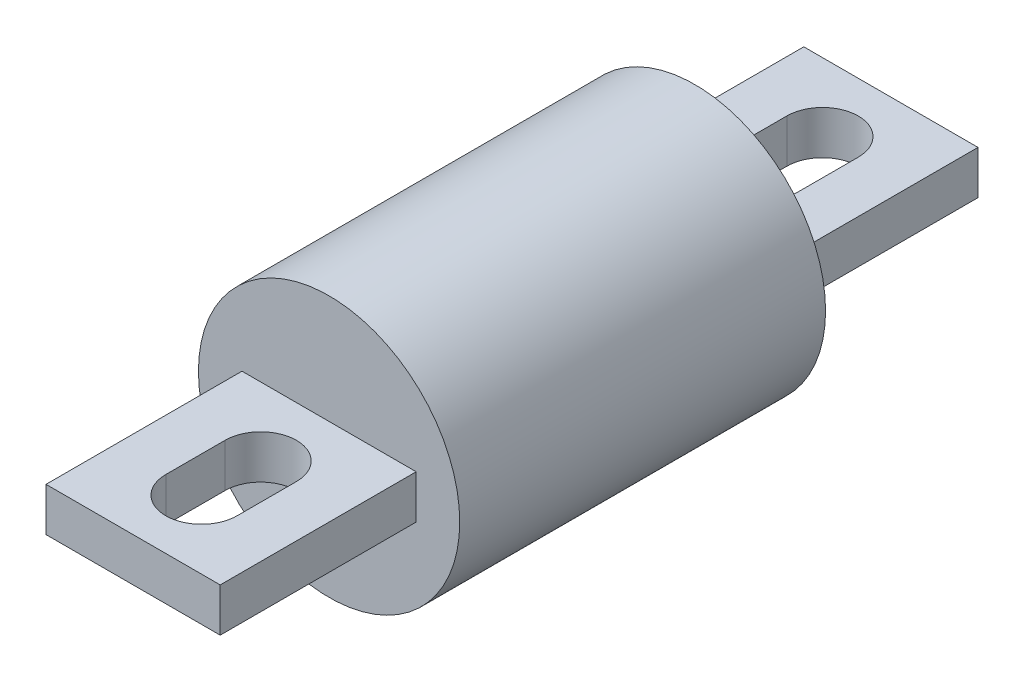
ISO-10303-21;
HEADER;
FILE_DESCRIPTION(('STEP AP214'),'2;1');
FILE_NAME('part.step','',(''),(''),'','','');
FILE_SCHEMA(('AUTOMOTIVE_DESIGN { 1 0 10303 214 1 1 1 1 }'));
ENDSEC;
DATA;
#1=APPLICATION_CONTEXT('core data for automotive mechanical design processes');
#2=APPLICATION_PROTOCOL_DEFINITION('international standard','automotive_design',2000,#1);
#3=PRODUCT_CONTEXT('',#1,'mechanical');
#4=PRODUCT('Part','Part','',(#3));
#5=PRODUCT_RELATED_PRODUCT_CATEGORY('part','',(#4));
#6=PRODUCT_DEFINITION_FORMATION('','',#4);
#7=PRODUCT_DEFINITION_CONTEXT('part definition',#1,'design');
#8=PRODUCT_DEFINITION('design','',#6,#7);
#9=PRODUCT_DEFINITION_SHAPE('','',#8);
#10=(LENGTH_UNIT() NAMED_UNIT(*) SI_UNIT(.MILLI.,.METRE.));
#11=(NAMED_UNIT(*) PLANE_ANGLE_UNIT() SI_UNIT($,.RADIAN.));
#12=(NAMED_UNIT(*) SI_UNIT($,.STERADIAN.) SOLID_ANGLE_UNIT());
#13=UNCERTAINTY_MEASURE_WITH_UNIT(LENGTH_MEASURE(1.E-05),#10,'distance_accuracy_value','');
#14=(GEOMETRIC_REPRESENTATION_CONTEXT(3) GLOBAL_UNCERTAINTY_ASSIGNED_CONTEXT((#13)) GLOBAL_UNIT_ASSIGNED_CONTEXT((#10,
#11,#12)) REPRESENTATION_CONTEXT('',''));
#15=CARTESIAN_POINT('',(0.,0.,0.));
#16=DIRECTION('',(0.,0.,1.));
#17=DIRECTION('',(1.,0.,0.));
#18=AXIS2_PLACEMENT_3D('',#15,#16,#17);
#19=CARTESIAN_POINT('',(0.,0.,-26.67));
#20=DIRECTION('',(0.,0.,1.));
#21=DIRECTION('',(1.,0.,0.));
#22=AXIS2_PLACEMENT_3D('',#19,#20,#21);
#23=CYLINDRICAL_SURFACE('',#22,19.05);
#24=CARTESIAN_POINT('',(0.,0.,-26.67));
#25=DIRECTION('',(0.,0.,1.));
#26=DIRECTION('',(1.,0.,0.));
#27=AXIS2_PLACEMENT_3D('',#24,#25,#26);
#28=CIRCLE('',#27,19.05);
#29=CARTESIAN_POINT('',(19.05,0.,-26.67));
#30=VERTEX_POINT('',#29);
#31=EDGE_CURVE('E11',#30,#30,#28,.T.);
#32=ORIENTED_EDGE('',*,*,#31,.T.);
#33=EDGE_LOOP('',(#32));
#34=FACE_BOUND('',#33,.T.);
#35=CARTESIAN_POINT('',(0.,0.,26.67));
#36=DIRECTION('',(0.,0.,1.));
#37=DIRECTION('',(1.,0.,0.));
#38=AXIS2_PLACEMENT_3D('',#35,#36,#37);
#39=CIRCLE('',#38,19.05);
#40=CARTESIAN_POINT('',(19.05,0.,26.67));
#41=VERTEX_POINT('',#40);
#42=EDGE_CURVE('E39',#41,#41,#39,.T.);
#43=ORIENTED_EDGE('',*,*,#42,.F.);
#44=EDGE_LOOP('',(#43));
#45=FACE_BOUND('',#44,.T.);
#46=ADVANCED_FACE('F32',(#34,#45),#23,.T.);
#47=CARTESIAN_POINT('',(0.,0.,-26.67));
#48=DIRECTION('',(0.,0.,1.));
#49=DIRECTION('',(1.,0.,0.));
#50=AXIS2_PLACEMENT_3D('',#47,#48,#49);
#51=PLANE('',#50);
#52=DIRECTION('',(0.,1.,0.));
#53=VECTOR('',#52,1.);
#54=CARTESIAN_POINT('',(-12.7,-3.175,-26.67));
#55=LINE('',#54,#53);
#56=CARTESIAN_POINT('',(-12.7,-3.175,-26.67));
#57=VERTEX_POINT('',#56);
#58=CARTESIAN_POINT('',(-12.7,3.175,-26.67));
#59=VERTEX_POINT('',#58);
#60=EDGE_CURVE('E54',#57,#59,#55,.T.);
#61=ORIENTED_EDGE('',*,*,#60,.F.);
#62=DIRECTION('',(1.,0.,0.));
#63=VECTOR('',#62,1.);
#64=CARTESIAN_POINT('',(-12.7,-3.175,-26.67));
#65=LINE('',#64,#63);
#66=CARTESIAN_POINT('',(12.7,-3.175,-26.67));
#67=VERTEX_POINT('',#66);
#68=EDGE_CURVE('E260',#57,#67,#65,.T.);
#69=ORIENTED_EDGE('',*,*,#68,.T.);
#70=DIRECTION('',(0.,1.,0.));
#71=VECTOR('',#70,1.);
#72=CARTESIAN_POINT('',(12.7,-3.175,-26.67));
#73=LINE('',#72,#71);
#74=CARTESIAN_POINT('',(12.7,3.175,-26.67));
#75=VERTEX_POINT('',#74);
#76=EDGE_CURVE('E272',#67,#75,#73,.T.);
#77=ORIENTED_EDGE('',*,*,#76,.T.);
#78=DIRECTION('',(1.,0.,0.));
#79=VECTOR('',#78,1.);
#80=CARTESIAN_POINT('',(-12.7,3.175,-26.67));
#81=LINE('',#80,#79);
#82=EDGE_CURVE('E228',#59,#75,#81,.T.);
#83=ORIENTED_EDGE('',*,*,#82,.F.);
#84=EDGE_LOOP('',(#61,#69,#77,#83));
#85=FACE_BOUND('',#84,.T.);
#86=ORIENTED_EDGE('',*,*,#31,.F.);
#87=EDGE_LOOP('',(#86));
#88=FACE_BOUND('',#87,.T.);
#89=ADVANCED_FACE('F280',(#85,#88),#51,.F.);
#90=CARTESIAN_POINT('',(0.,0.,26.67));
#91=DIRECTION('',(0.,0.,1.));
#92=DIRECTION('',(1.,0.,0.));
#93=AXIS2_PLACEMENT_3D('',#90,#91,#92);
#94=PLANE('',#93);
#95=DIRECTION('',(1.,0.,0.));
#96=VECTOR('',#95,1.);
#97=CARTESIAN_POINT('',(-12.7,-3.175,26.67));
#98=LINE('',#97,#96);
#99=CARTESIAN_POINT('',(-12.7,-3.175,26.67));
#100=VERTEX_POINT('',#99);
#101=CARTESIAN_POINT('',(12.7,-3.175,26.67));
#102=VERTEX_POINT('',#101);
#103=EDGE_CURVE('E202',#100,#102,#98,.T.);
#104=ORIENTED_EDGE('',*,*,#103,.F.);
#105=DIRECTION('',(0.,1.,0.));
#106=VECTOR('',#105,1.);
#107=CARTESIAN_POINT('',(-12.7,-3.175,26.67));
#108=LINE('',#107,#106);
#109=CARTESIAN_POINT('',(-12.7,3.175,26.67));
#110=VERTEX_POINT('',#109);
#111=EDGE_CURVE('E205',#100,#110,#108,.T.);
#112=ORIENTED_EDGE('',*,*,#111,.T.);
#113=DIRECTION('',(1.,0.,0.));
#114=VECTOR('',#113,1.);
#115=CARTESIAN_POINT('',(-12.7,3.175,26.67));
#116=LINE('',#115,#114);
#117=CARTESIAN_POINT('',(12.7,3.175,26.67));
#118=VERTEX_POINT('',#117);
#119=EDGE_CURVE('E182',#110,#118,#116,.T.);
#120=ORIENTED_EDGE('',*,*,#119,.T.);
#121=DIRECTION('',(0.,1.,0.));
#122=VECTOR('',#121,1.);
#123=CARTESIAN_POINT('',(12.7,-3.175,26.67));
#124=LINE('',#123,#122);
#125=EDGE_CURVE('E209',#102,#118,#124,.T.);
#126=ORIENTED_EDGE('',*,*,#125,.F.);
#127=EDGE_LOOP('',(#104,#112,#120,#126));
#128=FACE_BOUND('',#127,.T.);
#129=ORIENTED_EDGE('',*,*,#42,.T.);
#130=EDGE_LOOP('',(#129));
#131=FACE_BOUND('',#130,.T.);
#132=ADVANCED_FACE('F277',(#128,#131),#94,.T.);
#133=CARTESIAN_POINT('',(-12.7,-3.175,-26.67));
#134=DIRECTION('',(-1.,0.,0.));
#135=DIRECTION('',(0.,0.,1.));
#136=AXIS2_PLACEMENT_3D('',#133,#134,#135);
#137=PLANE('',#136);
#138=ORIENTED_EDGE('',*,*,#60,.T.);
#139=DIRECTION('',(0.,0.,1.));
#140=VECTOR('',#139,1.);
#141=CARTESIAN_POINT('',(-12.7,3.175,-26.67));
#142=LINE('',#141,#140);
#143=CARTESIAN_POINT('',(-12.7,3.175,-55.245));
#144=VERTEX_POINT('',#143);
#145=EDGE_CURVE('E225',#144,#59,#142,.T.);
#146=ORIENTED_EDGE('',*,*,#145,.F.);
#147=DIRECTION('',(0.,1.,0.));
#148=VECTOR('',#147,1.);
#149=CARTESIAN_POINT('',(-12.7,-3.175,-55.245));
#150=LINE('',#149,#148);
#151=CARTESIAN_POINT('',(-12.7,-3.175,-55.245));
#152=VERTEX_POINT('',#151);
#153=EDGE_CURVE('E268',#152,#144,#150,.T.);
#154=ORIENTED_EDGE('',*,*,#153,.F.);
#155=DIRECTION('',(0.,0.,1.));
#156=VECTOR('',#155,1.);
#157=CARTESIAN_POINT('',(-12.7,-3.175,-26.67));
#158=LINE('',#157,#156);
#159=EDGE_CURVE('E252',#152,#57,#158,.T.);
#160=ORIENTED_EDGE('',*,*,#159,.T.);
#161=EDGE_LOOP('',(#138,#146,#154,#160));
#162=FACE_BOUND('',#161,.T.);
#163=ADVANCED_FACE('F290',(#162),#137,.T.);
#164=CARTESIAN_POINT('',(-12.7,-3.175,-55.245));
#165=DIRECTION('',(0.,0.,-1.));
#166=DIRECTION('',(-1.,0.,0.));
#167=AXIS2_PLACEMENT_3D('',#164,#165,#166);
#168=PLANE('',#167);
#169=ORIENTED_EDGE('',*,*,#153,.T.);
#170=DIRECTION('',(-1.,0.,0.));
#171=VECTOR('',#170,1.);
#172=CARTESIAN_POINT('',(-12.7,3.175,-55.245));
#173=LINE('',#172,#171);
#174=CARTESIAN_POINT('',(12.7,3.175,-55.245));
#175=VERTEX_POINT('',#174);
#176=EDGE_CURVE('E234',#175,#144,#173,.T.);
#177=ORIENTED_EDGE('',*,*,#176,.F.);
#178=DIRECTION('',(0.,1.,0.));
#179=VECTOR('',#178,1.);
#180=CARTESIAN_POINT('',(12.7,-3.175,-55.245));
#181=LINE('',#180,#179);
#182=CARTESIAN_POINT('',(12.7,-3.175,-55.245));
#183=VERTEX_POINT('',#182);
#184=EDGE_CURVE('E270',#183,#175,#181,.T.);
#185=ORIENTED_EDGE('',*,*,#184,.F.);
#186=DIRECTION('',(-1.,0.,0.));
#187=VECTOR('',#186,1.);
#188=CARTESIAN_POINT('',(-12.7,-3.175,-55.245));
#189=LINE('',#188,#187);
#190=EDGE_CURVE('E265',#183,#152,#189,.T.);
#191=ORIENTED_EDGE('',*,*,#190,.T.);
#192=EDGE_LOOP('',(#169,#177,#185,#191));
#193=FACE_BOUND('',#192,.T.);
#194=ADVANCED_FACE('F296',(#193),#168,.T.);
#195=CARTESIAN_POINT('',(12.7,-3.175,-26.67));
#196=DIRECTION('',(1.,0.,0.));
#197=DIRECTION('',(0.,0.,-1.));
#198=AXIS2_PLACEMENT_3D('',#195,#196,#197);
#199=PLANE('',#198);
#200=ORIENTED_EDGE('',*,*,#184,.T.);
#201=DIRECTION('',(0.,0.,-1.));
#202=VECTOR('',#201,1.);
#203=CARTESIAN_POINT('',(12.7,3.175,-26.67));
#204=LINE('',#203,#202);
#205=EDGE_CURVE('E231',#75,#175,#204,.T.);
#206=ORIENTED_EDGE('',*,*,#205,.F.);
#207=ORIENTED_EDGE('',*,*,#76,.F.);
#208=DIRECTION('',(0.,0.,-1.));
#209=VECTOR('',#208,1.);
#210=CARTESIAN_POINT('',(12.7,-3.175,-26.67));
#211=LINE('',#210,#209);
#212=EDGE_CURVE('E262',#67,#183,#211,.T.);
#213=ORIENTED_EDGE('',*,*,#212,.T.);
#214=EDGE_LOOP('',(#200,#206,#207,#213));
#215=FACE_BOUND('',#214,.T.);
#216=ADVANCED_FACE('F298',(#215),#199,.T.);
#217=CARTESIAN_POINT('',(0.,-3.175,0.));
#218=DIRECTION('',(0.,-1.,0.));
#219=DIRECTION('',(0.,0.,-1.));
#220=AXIS2_PLACEMENT_3D('',#217,#218,#219);
#221=PLANE('',#220);
#222=CARTESIAN_POINT('',(0.,-3.175,-36.6395));
#223=DIRECTION('',(0.,1.,0.));
#224=DIRECTION('',(0.,0.,1.));
#225=AXIS2_PLACEMENT_3D('',#222,#223,#224);
#226=CIRCLE('',#225,5.207);
#227=CARTESIAN_POINT('',(-5.207,-3.175,-36.6395));
#228=VERTEX_POINT('',#227);
#229=CARTESIAN_POINT('',(5.207,-3.175,-36.6395));
#230=VERTEX_POINT('',#229);
#231=EDGE_CURVE('E237',#228,#230,#226,.T.);
#232=ORIENTED_EDGE('',*,*,#231,.T.);
#233=DIRECTION('',(0.,0.,-1.));
#234=VECTOR('',#233,1.);
#235=CARTESIAN_POINT('',(5.207,-3.175,-36.6395));
#236=LINE('',#235,#234);
#237=CARTESIAN_POINT('',(5.207,-3.175,-45.2755));
#238=VERTEX_POINT('',#237);
#239=EDGE_CURVE('E240',#230,#238,#236,.T.);
#240=ORIENTED_EDGE('',*,*,#239,.T.);
#241=CARTESIAN_POINT('',(0.,-3.175,-45.2755));
#242=DIRECTION('',(0.,1.,0.));
#243=DIRECTION('',(0.,0.,1.));
#244=AXIS2_PLACEMENT_3D('',#241,#242,#243);
#245=CIRCLE('',#244,5.207);
#246=CARTESIAN_POINT('',(-5.207,-3.175,-45.2755));
#247=VERTEX_POINT('',#246);
#248=EDGE_CURVE('E243',#238,#247,#245,.T.);
#249=ORIENTED_EDGE('',*,*,#248,.T.);
#250=DIRECTION('',(0.,0.,1.));
#251=VECTOR('',#250,1.);
#252=CARTESIAN_POINT('',(-5.207,-3.175,-36.6395));
#253=LINE('',#252,#251);
#254=EDGE_CURVE('E246',#247,#228,#253,.T.);
#255=ORIENTED_EDGE('',*,*,#254,.T.);
#256=EDGE_LOOP('',(#232,#240,#249,#255));
#257=FACE_BOUND('',#256,.T.);
#258=ORIENTED_EDGE('',*,*,#159,.F.);
#259=ORIENTED_EDGE('',*,*,#190,.F.);
#260=ORIENTED_EDGE('',*,*,#212,.F.);
#261=ORIENTED_EDGE('',*,*,#68,.F.);
#262=EDGE_LOOP('',(#258,#259,#260,#261));
#263=FACE_BOUND('',#262,.T.);
#264=ADVANCED_FACE('F301',(#257,#263),#221,.T.);
#265=CARTESIAN_POINT('',(0.,-3.175,-36.6395));
#266=DIRECTION('',(0.,1.,0.));
#267=DIRECTION('',(0.,0.,1.));
#268=AXIS2_PLACEMENT_3D('',#265,#266,#267);
#269=CYLINDRICAL_SURFACE('',#268,5.207);
#270=DIRECTION('',(0.,1.,0.));
#271=VECTOR('',#270,1.);
#272=CARTESIAN_POINT('',(-5.207,-3.175,-36.6395));
#273=LINE('',#272,#271);
#274=CARTESIAN_POINT('',(-5.207,3.175,-36.6395));
#275=VERTEX_POINT('',#274);
#276=EDGE_CURVE('E250',#228,#275,#273,.T.);
#277=ORIENTED_EDGE('',*,*,#276,.T.);
#278=CARTESIAN_POINT('',(0.,3.175,-36.6395));
#279=DIRECTION('',(0.,1.,0.));
#280=DIRECTION('',(0.,0.,1.));
#281=AXIS2_PLACEMENT_3D('',#278,#279,#280);
#282=CIRCLE('',#281,5.207);
#283=CARTESIAN_POINT('',(5.207,3.175,-36.6395));
#284=VERTEX_POINT('',#283);
#285=EDGE_CURVE('E208',#275,#284,#282,.T.);
#286=ORIENTED_EDGE('',*,*,#285,.T.);
#287=DIRECTION('',(0.,1.,0.));
#288=VECTOR('',#287,1.);
#289=CARTESIAN_POINT('',(5.207,-3.175,-36.6395));
#290=LINE('',#289,#288);
#291=EDGE_CURVE('E249',#230,#284,#290,.T.);
#292=ORIENTED_EDGE('',*,*,#291,.F.);
#293=ORIENTED_EDGE('',*,*,#231,.F.);
#294=EDGE_LOOP('',(#277,#286,#292,#293));
#295=FACE_BOUND('',#294,.T.);
#296=ADVANCED_FACE('F308',(#295),#269,.F.);
#297=CARTESIAN_POINT('',(-5.207,-3.175,-36.6395));
#298=DIRECTION('',(-1.,0.,0.));
#299=DIRECTION('',(0.,0.,1.));
#300=AXIS2_PLACEMENT_3D('',#297,#298,#299);
#301=PLANE('',#300);
#302=DIRECTION('',(0.,1.,0.));
#303=VECTOR('',#302,1.);
#304=CARTESIAN_POINT('',(-5.207,-3.175,-45.2755));
#305=LINE('',#304,#303);
#306=CARTESIAN_POINT('',(-5.207,3.175,-45.2755));
#307=VERTEX_POINT('',#306);
#308=EDGE_CURVE('E253',#247,#307,#305,.T.);
#309=ORIENTED_EDGE('',*,*,#308,.T.);
#310=DIRECTION('',(0.,0.,1.));
#311=VECTOR('',#310,1.);
#312=CARTESIAN_POINT('',(-5.207,3.175,-36.6395));
#313=LINE('',#312,#311);
#314=EDGE_CURVE('E222',#307,#275,#313,.T.);
#315=ORIENTED_EDGE('',*,*,#314,.T.);
#316=ORIENTED_EDGE('',*,*,#276,.F.);
#317=ORIENTED_EDGE('',*,*,#254,.F.);
#318=EDGE_LOOP('',(#309,#315,#316,#317));
#319=FACE_BOUND('',#318,.T.);
#320=ADVANCED_FACE('F312',(#319),#301,.F.);
#321=CARTESIAN_POINT('',(0.,-3.175,-45.2755));
#322=DIRECTION('',(0.,1.,0.));
#323=DIRECTION('',(0.,0.,1.));
#324=AXIS2_PLACEMENT_3D('',#321,#322,#323);
#325=CYLINDRICAL_SURFACE('',#324,5.207);
#326=DIRECTION('',(0.,1.,0.));
#327=VECTOR('',#326,1.);
#328=CARTESIAN_POINT('',(5.207,-3.175,-45.2755));
#329=LINE('',#328,#327);
#330=CARTESIAN_POINT('',(5.207,3.175,-45.2755));
#331=VERTEX_POINT('',#330);
#332=EDGE_CURVE('E255',#238,#331,#329,.T.);
#333=ORIENTED_EDGE('',*,*,#332,.T.);
#334=CARTESIAN_POINT('',(0.,3.175,-45.2755));
#335=DIRECTION('',(0.,1.,0.));
#336=DIRECTION('',(0.,0.,1.));
#337=AXIS2_PLACEMENT_3D('',#334,#335,#336);
#338=CIRCLE('',#337,5.207);
#339=EDGE_CURVE('E219',#331,#307,#338,.T.);
#340=ORIENTED_EDGE('',*,*,#339,.T.);
#341=ORIENTED_EDGE('',*,*,#308,.F.);
#342=ORIENTED_EDGE('',*,*,#248,.F.);
#343=EDGE_LOOP('',(#333,#340,#341,#342));
#344=FACE_BOUND('',#343,.T.);
#345=ADVANCED_FACE('F318',(#344),#325,.F.);
#346=CARTESIAN_POINT('',(5.207,-3.175,-36.6395));
#347=DIRECTION('',(1.,0.,0.));
#348=DIRECTION('',(0.,0.,-1.));
#349=AXIS2_PLACEMENT_3D('',#346,#347,#348);
#350=PLANE('',#349);
#351=ORIENTED_EDGE('',*,*,#291,.T.);
#352=DIRECTION('',(0.,0.,-1.));
#353=VECTOR('',#352,1.);
#354=CARTESIAN_POINT('',(5.207,3.175,-36.6395));
#355=LINE('',#354,#353);
#356=EDGE_CURVE('E216',#284,#331,#355,.T.);
#357=ORIENTED_EDGE('',*,*,#356,.T.);
#358=ORIENTED_EDGE('',*,*,#332,.F.);
#359=ORIENTED_EDGE('',*,*,#239,.F.);
#360=EDGE_LOOP('',(#351,#357,#358,#359));
#361=FACE_BOUND('',#360,.T.);
#362=ADVANCED_FACE('F314',(#361),#350,.F.);
#363=CARTESIAN_POINT('',(0.,3.175,0.));
#364=DIRECTION('',(0.,-1.,0.));
#365=DIRECTION('',(0.,0.,-1.));
#366=AXIS2_PLACEMENT_3D('',#363,#364,#365);
#367=PLANE('',#366);
#368=ORIENTED_EDGE('',*,*,#145,.T.);
#369=ORIENTED_EDGE('',*,*,#82,.T.);
#370=ORIENTED_EDGE('',*,*,#205,.T.);
#371=ORIENTED_EDGE('',*,*,#176,.T.);
#372=EDGE_LOOP('',(#368,#369,#370,#371));
#373=FACE_BOUND('',#372,.T.);
#374=ORIENTED_EDGE('',*,*,#285,.F.);
#375=ORIENTED_EDGE('',*,*,#314,.F.);
#376=ORIENTED_EDGE('',*,*,#339,.F.);
#377=ORIENTED_EDGE('',*,*,#356,.F.);
#378=EDGE_LOOP('',(#374,#375,#376,#377));
#379=FACE_BOUND('',#378,.T.);
#380=ADVANCED_FACE('F317',(#373,#379),#367,.F.);
#381=CARTESIAN_POINT('',(0.,-3.175,0.));
#382=DIRECTION('',(0.,-1.,0.));
#383=DIRECTION('',(0.,0.,1.));
#384=AXIS2_PLACEMENT_3D('',#381,#382,#383);
#385=PLANE('',#384);
#386=DIRECTION('',(0.,0.,-1.));
#387=VECTOR('',#386,1.);
#388=CARTESIAN_POINT('',(-12.7,-3.175,26.67));
#389=LINE('',#388,#387);
#390=CARTESIAN_POINT('',(-12.7,-3.175,55.245));
#391=VERTEX_POINT('',#390);
#392=EDGE_CURVE('E193',#391,#100,#389,.T.);
#393=ORIENTED_EDGE('',*,*,#392,.T.);
#394=ORIENTED_EDGE('',*,*,#103,.T.);
#395=DIRECTION('',(0.,0.,1.));
#396=VECTOR('',#395,1.);
#397=CARTESIAN_POINT('',(12.7,-3.175,26.67));
#398=LINE('',#397,#396);
#399=CARTESIAN_POINT('',(12.7,-3.175,55.245));
#400=VERTEX_POINT('',#399);
#401=EDGE_CURVE('E200',#102,#400,#398,.T.);
#402=ORIENTED_EDGE('',*,*,#401,.T.);
#403=DIRECTION('',(-1.,0.,0.));
#404=VECTOR('',#403,1.);
#405=CARTESIAN_POINT('',(-12.7,-3.175,55.245));
#406=LINE('',#405,#404);
#407=EDGE_CURVE('E198',#400,#391,#406,.T.);
#408=ORIENTED_EDGE('',*,*,#407,.T.);
#409=EDGE_LOOP('',(#393,#394,#402,#408));
#410=FACE_BOUND('',#409,.T.);
#411=DIRECTION('',(0.,0.,1.));
#412=VECTOR('',#411,1.);
#413=CARTESIAN_POINT('',(5.207,-3.175,36.6395));
#414=LINE('',#413,#412);
#415=CARTESIAN_POINT('',(5.207,-3.175,36.6395));
#416=VERTEX_POINT('',#415);
#417=CARTESIAN_POINT('',(5.207,-3.175,45.2755));
#418=VERTEX_POINT('',#417);
#419=EDGE_CURVE('E157',#416,#418,#414,.T.);
#420=ORIENTED_EDGE('',*,*,#419,.F.);
#421=CARTESIAN_POINT('',(0.,-3.175,36.6395));
#422=DIRECTION('',(0.,-1.,0.));
#423=DIRECTION('',(0.,0.,-1.));
#424=AXIS2_PLACEMENT_3D('',#421,#422,#423);
#425=CIRCLE('',#424,5.207);
#426=CARTESIAN_POINT('',(-5.207,-3.175,36.6395));
#427=VERTEX_POINT('',#426);
#428=EDGE_CURVE('E185',#427,#416,#425,.T.);
#429=ORIENTED_EDGE('',*,*,#428,.F.);
#430=DIRECTION('',(0.,0.,-1.));
#431=VECTOR('',#430,1.);
#432=CARTESIAN_POINT('',(-5.207,-3.175,36.6395));
#433=LINE('',#432,#431);
#434=CARTESIAN_POINT('',(-5.207,-3.175,45.2755));
#435=VERTEX_POINT('',#434);
#436=EDGE_CURVE('E153',#435,#427,#433,.T.);
#437=ORIENTED_EDGE('',*,*,#436,.F.);
#438=CARTESIAN_POINT('',(0.,-3.175,45.2755));
#439=DIRECTION('',(0.,-1.,0.));
#440=DIRECTION('',(0.,0.,-1.));
#441=AXIS2_PLACEMENT_3D('',#438,#439,#440);
#442=CIRCLE('',#441,5.207);
#443=EDGE_CURVE('E188',#418,#435,#442,.T.);
#444=ORIENTED_EDGE('',*,*,#443,.F.);
#445=EDGE_LOOP('',(#420,#429,#437,#444));
#446=FACE_BOUND('',#445,.T.);
#447=ADVANCED_FACE('F328',(#410,#446),#385,.T.);
#448=CARTESIAN_POINT('',(-12.7,-3.175,26.67));
#449=DIRECTION('',(1.,0.,0.));
#450=DIRECTION('',(0.,0.,-1.));
#451=AXIS2_PLACEMENT_3D('',#448,#449,#450);
#452=PLANE('',#451);
#453=DIRECTION('',(0.,1.,0.));
#454=VECTOR('',#453,1.);
#455=CARTESIAN_POINT('',(-12.7,-3.175,55.245));
#456=LINE('',#455,#454);
#457=CARTESIAN_POINT('',(-12.7,3.175,55.245));
#458=VERTEX_POINT('',#457);
#459=EDGE_CURVE('E204',#391,#458,#456,.T.);
#460=ORIENTED_EDGE('',*,*,#459,.T.);
#461=DIRECTION('',(0.,0.,-1.));
#462=VECTOR('',#461,1.);
#463=CARTESIAN_POINT('',(-12.7,3.175,26.67));
#464=LINE('',#463,#462);
#465=EDGE_CURVE('E176',#458,#110,#464,.T.);
#466=ORIENTED_EDGE('',*,*,#465,.T.);
#467=ORIENTED_EDGE('',*,*,#111,.F.);
#468=ORIENTED_EDGE('',*,*,#392,.F.);
#469=EDGE_LOOP('',(#460,#466,#467,#468));
#470=FACE_BOUND('',#469,.T.);
#471=ADVANCED_FACE('F330',(#470),#452,.F.);
#472=CARTESIAN_POINT('',(12.7,-3.175,26.67));
#473=DIRECTION('',(-1.,0.,0.));
#474=DIRECTION('',(0.,0.,1.));
#475=AXIS2_PLACEMENT_3D('',#472,#473,#474);
#476=PLANE('',#475);
#477=ORIENTED_EDGE('',*,*,#125,.T.);
#478=DIRECTION('',(0.,0.,1.));
#479=VECTOR('',#478,1.);
#480=CARTESIAN_POINT('',(12.7,3.175,26.67));
#481=LINE('',#480,#479);
#482=CARTESIAN_POINT('',(12.7,3.175,55.245));
#483=VERTEX_POINT('',#482);
#484=EDGE_CURVE('E46',#118,#483,#481,.T.);
#485=ORIENTED_EDGE('',*,*,#484,.T.);
#486=DIRECTION('',(0.,1.,0.));
#487=VECTOR('',#486,1.);
#488=CARTESIAN_POINT('',(12.7,-3.175,55.245));
#489=LINE('',#488,#487);
#490=EDGE_CURVE('E211',#400,#483,#489,.T.);
#491=ORIENTED_EDGE('',*,*,#490,.F.);
#492=ORIENTED_EDGE('',*,*,#401,.F.);
#493=EDGE_LOOP('',(#477,#485,#491,#492));
#494=FACE_BOUND('',#493,.T.);
#495=ADVANCED_FACE('F333',(#494),#476,.F.);
#496=CARTESIAN_POINT('',(-12.7,-3.175,55.245));
#497=DIRECTION('',(0.,0.,-1.));
#498=DIRECTION('',(-1.,0.,0.));
#499=AXIS2_PLACEMENT_3D('',#496,#497,#498);
#500=PLANE('',#499);
#501=ORIENTED_EDGE('',*,*,#490,.T.);
#502=DIRECTION('',(-1.,0.,0.));
#503=VECTOR('',#502,1.);
#504=CARTESIAN_POINT('',(-12.7,3.175,55.245));
#505=LINE('',#504,#503);
#506=EDGE_CURVE('E178',#483,#458,#505,.T.);
#507=ORIENTED_EDGE('',*,*,#506,.T.);
#508=ORIENTED_EDGE('',*,*,#459,.F.);
#509=ORIENTED_EDGE('',*,*,#407,.F.);
#510=EDGE_LOOP('',(#501,#507,#508,#509));
#511=FACE_BOUND('',#510,.T.);
#512=ADVANCED_FACE('F335',(#511),#500,.F.);
#513=CARTESIAN_POINT('',(0.,-3.175,36.6395));
#514=DIRECTION('',(0.,1.,0.));
#515=DIRECTION('',(0.,0.,1.));
#516=AXIS2_PLACEMENT_3D('',#513,#514,#515);
#517=CYLINDRICAL_SURFACE('',#516,5.207);
#518=DIRECTION('',(0.,1.,0.));
#519=VECTOR('',#518,1.);
#520=CARTESIAN_POINT('',(5.207,-3.175,36.6395));
#521=LINE('',#520,#519);
#522=CARTESIAN_POINT('',(5.207,3.175,36.6395));
#523=VERTEX_POINT('',#522);
#524=EDGE_CURVE('E163',#416,#523,#521,.T.);
#525=ORIENTED_EDGE('',*,*,#524,.T.);
#526=CARTESIAN_POINT('',(0.,3.175,36.6395));
#527=DIRECTION('',(0.,-1.,0.));
#528=DIRECTION('',(0.,0.,-1.));
#529=AXIS2_PLACEMENT_3D('',#526,#527,#528);
#530=CIRCLE('',#529,5.207);
#531=CARTESIAN_POINT('',(-5.207,3.175,36.6395));
#532=VERTEX_POINT('',#531);
#533=EDGE_CURVE('E160',#532,#523,#530,.T.);
#534=ORIENTED_EDGE('',*,*,#533,.F.);
#535=DIRECTION('',(0.,1.,0.));
#536=VECTOR('',#535,1.);
#537=CARTESIAN_POINT('',(-5.207,-3.175,36.6395));
#538=LINE('',#537,#536);
#539=EDGE_CURVE('E146',#427,#532,#538,.T.);
#540=ORIENTED_EDGE('',*,*,#539,.F.);
#541=ORIENTED_EDGE('',*,*,#428,.T.);
#542=EDGE_LOOP('',(#525,#534,#540,#541));
#543=FACE_BOUND('',#542,.T.);
#544=ADVANCED_FACE('F161',(#543),#517,.F.);
#545=CARTESIAN_POINT('',(5.207,-3.175,36.6395));
#546=DIRECTION('',(-1.,0.,0.));
#547=DIRECTION('',(0.,0.,1.));
#548=AXIS2_PLACEMENT_3D('',#545,#546,#547);
#549=PLANE('',#548);
#550=DIRECTION('',(0.,1.,0.));
#551=VECTOR('',#550,1.);
#552=CARTESIAN_POINT('',(5.207,-3.175,45.2755));
#553=LINE('',#552,#551);
#554=CARTESIAN_POINT('',(5.207,3.175,45.2755));
#555=VERTEX_POINT('',#554);
#556=EDGE_CURVE('E194',#418,#555,#553,.T.);
#557=ORIENTED_EDGE('',*,*,#556,.T.);
#558=DIRECTION('',(0.,0.,1.));
#559=VECTOR('',#558,1.);
#560=CARTESIAN_POINT('',(5.207,3.175,36.6395));
#561=LINE('',#560,#559);
#562=EDGE_CURVE('E172',#523,#555,#561,.T.);
#563=ORIENTED_EDGE('',*,*,#562,.F.);
#564=ORIENTED_EDGE('',*,*,#524,.F.);
#565=ORIENTED_EDGE('',*,*,#419,.T.);
#566=EDGE_LOOP('',(#557,#563,#564,#565));
#567=FACE_BOUND('',#566,.T.);
#568=ADVANCED_FACE('F347',(#567),#549,.T.);
#569=CARTESIAN_POINT('',(0.,-3.175,45.2755));
#570=DIRECTION('',(0.,1.,0.));
#571=DIRECTION('',(0.,0.,1.));
#572=AXIS2_PLACEMENT_3D('',#569,#570,#571);
#573=CYLINDRICAL_SURFACE('',#572,5.207);
#574=DIRECTION('',(0.,1.,0.));
#575=VECTOR('',#574,1.);
#576=CARTESIAN_POINT('',(-5.207,-3.175,45.2755));
#577=LINE('',#576,#575);
#578=CARTESIAN_POINT('',(-5.207,3.175,45.2755));
#579=VERTEX_POINT('',#578);
#580=EDGE_CURVE('E156',#435,#579,#577,.T.);
#581=ORIENTED_EDGE('',*,*,#580,.T.);
#582=CARTESIAN_POINT('',(0.,3.175,45.2755));
#583=DIRECTION('',(0.,-1.,0.));
#584=DIRECTION('',(0.,0.,-1.));
#585=AXIS2_PLACEMENT_3D('',#582,#583,#584);
#586=CIRCLE('',#585,5.207);
#587=EDGE_CURVE('E170',#555,#579,#586,.T.);
#588=ORIENTED_EDGE('',*,*,#587,.F.);
#589=ORIENTED_EDGE('',*,*,#556,.F.);
#590=ORIENTED_EDGE('',*,*,#443,.T.);
#591=EDGE_LOOP('',(#581,#588,#589,#590));
#592=FACE_BOUND('',#591,.T.);
#593=ADVANCED_FACE('F350',(#592),#573,.F.);
#594=CARTESIAN_POINT('',(-5.207,-3.175,36.6395));
#595=DIRECTION('',(1.,0.,0.));
#596=DIRECTION('',(0.,0.,-1.));
#597=AXIS2_PLACEMENT_3D('',#594,#595,#596);
#598=PLANE('',#597);
#599=ORIENTED_EDGE('',*,*,#539,.T.);
#600=DIRECTION('',(0.,0.,-1.));
#601=VECTOR('',#600,1.);
#602=CARTESIAN_POINT('',(-5.207,3.175,36.6395));
#603=LINE('',#602,#601);
#604=EDGE_CURVE('E150',#579,#532,#603,.T.);
#605=ORIENTED_EDGE('',*,*,#604,.F.);
#606=ORIENTED_EDGE('',*,*,#580,.F.);
#607=ORIENTED_EDGE('',*,*,#436,.T.);
#608=EDGE_LOOP('',(#599,#605,#606,#607));
#609=FACE_BOUND('',#608,.T.);
#610=ADVANCED_FACE('F148',(#609),#598,.T.);
#611=CARTESIAN_POINT('',(0.,3.175,0.));
#612=DIRECTION('',(0.,-1.,0.));
#613=DIRECTION('',(0.,0.,1.));
#614=AXIS2_PLACEMENT_3D('',#611,#612,#613);
#615=PLANE('',#614);
#616=ORIENTED_EDGE('',*,*,#604,.T.);
#617=ORIENTED_EDGE('',*,*,#533,.T.);
#618=ORIENTED_EDGE('',*,*,#562,.T.);
#619=ORIENTED_EDGE('',*,*,#587,.T.);
#620=EDGE_LOOP('',(#616,#617,#618,#619));
#621=FACE_BOUND('',#620,.T.);
#622=ORIENTED_EDGE('',*,*,#465,.F.);
#623=ORIENTED_EDGE('',*,*,#506,.F.);
#624=ORIENTED_EDGE('',*,*,#484,.F.);
#625=ORIENTED_EDGE('',*,*,#119,.F.);
#626=EDGE_LOOP('',(#622,#623,#624,#625));
#627=FACE_BOUND('',#626,.T.);
#628=ADVANCED_FACE('F168',(#621,#627),#615,.F.);
#629=CLOSED_SHELL('',(#46,#89,#132,#163,#194,#216,#264,#296,#320,#345,#362,#380,#447,#471,#495,
#512,#544,#568,#593,#610,#628));
#630=MANIFOLD_SOLID_BREP('B2',#629);
#631=ADVANCED_BREP_SHAPE_REPRESENTATION('',(#18,#630),#14);
#632=SHAPE_DEFINITION_REPRESENTATION(#9,#631);
ENDSEC;
END-ISO-10303-21;
